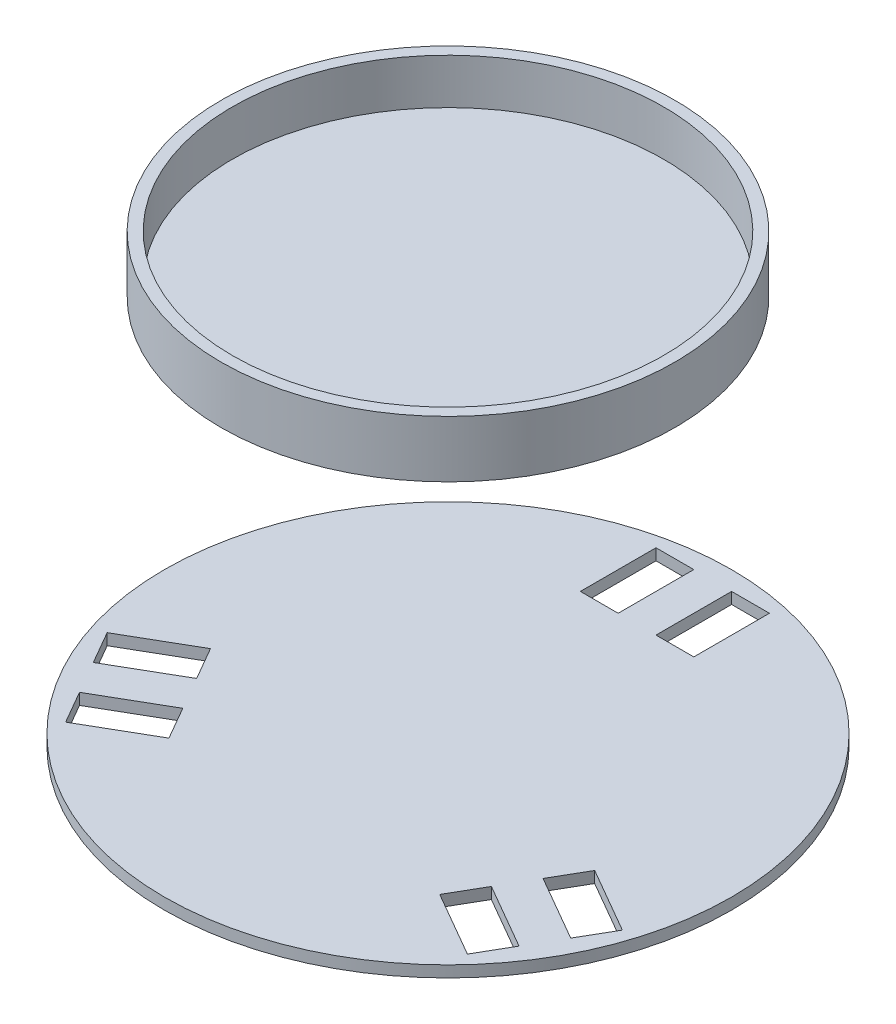
ISO-10303-21;
HEADER;
FILE_DESCRIPTION(('STEP AP214'),'2;1');
FILE_NAME('part.step','',(''),(''),'','','');
FILE_SCHEMA(('AUTOMOTIVE_DESIGN { 1 0 10303 214 1 1 1 1 }'));
ENDSEC;
DATA;
#1=APPLICATION_CONTEXT('core data for automotive mechanical design processes');
#2=APPLICATION_PROTOCOL_DEFINITION('international standard','automotive_design',2000,#1);
#3=PRODUCT_CONTEXT('',#1,'mechanical');
#4=PRODUCT('Part','Part','',(#3));
#5=PRODUCT_RELATED_PRODUCT_CATEGORY('part','',(#4));
#6=PRODUCT_DEFINITION_FORMATION('','',#4);
#7=PRODUCT_DEFINITION_CONTEXT('part definition',#1,'design');
#8=PRODUCT_DEFINITION('design','',#6,#7);
#9=PRODUCT_DEFINITION_SHAPE('','',#8);
#10=(LENGTH_UNIT() NAMED_UNIT(*) SI_UNIT(.MILLI.,.METRE.));
#11=(NAMED_UNIT(*) PLANE_ANGLE_UNIT() SI_UNIT($,.RADIAN.));
#12=(NAMED_UNIT(*) SI_UNIT($,.STERADIAN.) SOLID_ANGLE_UNIT());
#13=UNCERTAINTY_MEASURE_WITH_UNIT(LENGTH_MEASURE(1.E-05),#10,'distance_accuracy_value','');
#14=(GEOMETRIC_REPRESENTATION_CONTEXT(3) GLOBAL_UNCERTAINTY_ASSIGNED_CONTEXT((#13)) GLOBAL_UNIT_ASSIGNED_CONTEXT((#10,
#11,#12)) REPRESENTATION_CONTEXT('',''));
#15=CARTESIAN_POINT('',(0.,0.,0.));
#16=DIRECTION('',(0.,0.,1.));
#17=DIRECTION('',(1.,0.,0.));
#18=AXIS2_PLACEMENT_3D('',#15,#16,#17);
#19=CARTESIAN_POINT('',(0.,212.,0.));
#20=DIRECTION('',(0.,-1.,0.));
#21=DIRECTION('',(0.,0.,-1.));
#22=AXIS2_PLACEMENT_3D('',#19,#20,#21);
#23=CYLINDRICAL_SURFACE('',#22,120.);
#24=CARTESIAN_POINT('',(0.,206.,0.));
#25=DIRECTION('',(0.,1.,0.));
#26=DIRECTION('',(0.,0.,1.));
#27=AXIS2_PLACEMENT_3D('',#24,#25,#26);
#28=CIRCLE('',#27,120.);
#29=CARTESIAN_POINT('',(0.,206.,120.));
#30=VERTEX_POINT('',#29);
#31=EDGE_CURVE('E47',#30,#30,#28,.T.);
#32=ORIENTED_EDGE('',*,*,#31,.T.);
#33=EDGE_LOOP('',(#32));
#34=FACE_BOUND('',#33,.T.);
#35=CARTESIAN_POINT('',(0.,236.,0.));
#36=DIRECTION('',(0.,1.,0.));
#37=DIRECTION('',(0.,0.,1.));
#38=AXIS2_PLACEMENT_3D('',#35,#36,#37);
#39=CIRCLE('',#38,120.);
#40=CARTESIAN_POINT('',(0.,236.,120.));
#41=VERTEX_POINT('',#40);
#42=EDGE_CURVE('E51',#41,#41,#39,.T.);
#43=ORIENTED_EDGE('',*,*,#42,.F.);
#44=EDGE_LOOP('',(#43));
#45=FACE_BOUND('',#44,.T.);
#46=ADVANCED_FACE('F41',(#34,#45),#23,.T.);
#47=CARTESIAN_POINT('',(0.,206.,0.));
#48=DIRECTION('',(0.,1.,0.));
#49=DIRECTION('',(0.,0.,1.));
#50=AXIS2_PLACEMENT_3D('',#47,#48,#49);
#51=PLANE('',#50);
#52=ORIENTED_EDGE('',*,*,#31,.F.);
#53=EDGE_LOOP('',(#52));
#54=FACE_BOUND('',#53,.T.);
#55=ADVANCED_FACE('F65',(#54),#51,.F.);
#56=CARTESIAN_POINT('',(0.,236.,0.));
#57=DIRECTION('',(0.,1.,0.));
#58=DIRECTION('',(0.,0.,1.));
#59=AXIS2_PLACEMENT_3D('',#56,#57,#58);
#60=PLANE('',#59);
#61=ORIENTED_EDGE('',*,*,#42,.T.);
#62=EDGE_LOOP('',(#61));
#63=FACE_BOUND('',#62,.T.);
#64=CARTESIAN_POINT('',(0.,236.,0.));
#65=DIRECTION('',(0.,1.,0.));
#66=DIRECTION('',(0.,0.,1.));
#67=AXIS2_PLACEMENT_3D('',#64,#65,#66);
#68=CIRCLE('',#67,114.);
#69=CARTESIAN_POINT('',(0.,236.,114.));
#70=VERTEX_POINT('',#69);
#71=EDGE_CURVE('E55',#70,#70,#68,.T.);
#72=ORIENTED_EDGE('',*,*,#71,.F.);
#73=EDGE_LOOP('',(#72));
#74=FACE_BOUND('',#73,.T.);
#75=ADVANCED_FACE('F63',(#63,#74),#60,.T.);
#76=CARTESIAN_POINT('',(0.,236.,0.));
#77=DIRECTION('',(0.,-1.,0.));
#78=DIRECTION('',(0.,0.,-1.));
#79=AXIS2_PLACEMENT_3D('',#76,#77,#78);
#80=CYLINDRICAL_SURFACE('',#79,114.);
#81=ORIENTED_EDGE('',*,*,#71,.T.);
#82=EDGE_LOOP('',(#81));
#83=FACE_BOUND('',#82,.T.);
#84=CARTESIAN_POINT('',(0.,212.,0.));
#85=DIRECTION('',(0.,1.,0.));
#86=DIRECTION('',(0.,0.,1.));
#87=AXIS2_PLACEMENT_3D('',#84,#85,#86);
#88=CIRCLE('',#87,114.);
#89=CARTESIAN_POINT('',(0.,212.,114.));
#90=VERTEX_POINT('',#89);
#91=EDGE_CURVE('E11',#90,#90,#88,.F.);
#92=ORIENTED_EDGE('',*,*,#91,.T.);
#93=EDGE_LOOP('',(#92));
#94=FACE_BOUND('',#93,.T.);
#95=ADVANCED_FACE('F61',(#83,#94),#80,.F.);
#96=CARTESIAN_POINT('',(0.,212.,0.));
#97=DIRECTION('',(0.,1.,0.));
#98=DIRECTION('',(0.,0.,1.));
#99=AXIS2_PLACEMENT_3D('',#96,#97,#98);
#100=PLANE('',#99);
#101=ORIENTED_EDGE('',*,*,#91,.F.);
#102=EDGE_LOOP('',(#101));
#103=FACE_BOUND('',#102,.T.);
#104=ADVANCED_FACE('F72',(#103),#100,.T.);
#105=CLOSED_SHELL('',(#46,#55,#75,#95,#104));
#106=MANIFOLD_SOLID_BREP('B2',#105);
#107=CARTESIAN_POINT('',(0.,6.,0.));
#108=DIRECTION('',(0.,-1.,0.));
#109=DIRECTION('',(0.,0.,-1.));
#110=AXIS2_PLACEMENT_3D('',#107,#108,#109);
#111=CYLINDRICAL_SURFACE('',#110,150.);
#112=CARTESIAN_POINT('',(0.,6.,0.));
#113=DIRECTION('',(0.,1.,0.));
#114=DIRECTION('',(0.,0.,1.));
#115=AXIS2_PLACEMENT_3D('',#112,#113,#114);
#116=CIRCLE('',#115,150.);
#117=CARTESIAN_POINT('',(0.,6.,150.));
#118=VERTEX_POINT('',#117);
#119=EDGE_CURVE('E39',#118,#118,#116,.T.);
#120=ORIENTED_EDGE('',*,*,#119,.F.);
#121=EDGE_LOOP('',(#120));
#122=FACE_BOUND('',#121,.T.);
#123=CARTESIAN_POINT('',(0.,0.,0.));
#124=DIRECTION('',(0.,1.,0.));
#125=DIRECTION('',(0.,0.,1.));
#126=AXIS2_PLACEMENT_3D('',#123,#124,#125);
#127=CIRCLE('',#126,150.);
#128=CARTESIAN_POINT('',(0.,0.,150.));
#129=VERTEX_POINT('',#128);
#130=EDGE_CURVE('E118',#129,#129,#127,.T.);
#131=ORIENTED_EDGE('',*,*,#130,.T.);
#132=EDGE_LOOP('',(#131));
#133=FACE_BOUND('',#132,.T.);
#134=ADVANCED_FACE('F115',(#122,#133),#111,.T.);
#135=CARTESIAN_POINT('',(0.,6.,0.));
#136=DIRECTION('',(0.,1.,0.));
#137=DIRECTION('',(0.,0.,1.));
#138=AXIS2_PLACEMENT_3D('',#135,#136,#137);
#139=PLANE('',#138);
#140=DIRECTION('',(0.5,0.,0.866025403784438));
#141=VECTOR('',#140,1.);
#142=CARTESIAN_POINT('',(-126.243556529779,6.,61.3397459621752));
#143=LINE('',#142,#141);
#144=CARTESIAN_POINT('',(-136.243556529779,6.,44.0192378864865));
#145=VERTEX_POINT('',#144);
#146=CARTESIAN_POINT('',(-126.243556529779,6.,61.3397459621752));
#147=VERTEX_POINT('',#146);
#148=EDGE_CURVE('E129',#145,#147,#143,.T.);
#149=ORIENTED_EDGE('',*,*,#148,.F.);
#150=DIRECTION('',(-0.866025403784438,0.,0.5));
#151=VECTOR('',#150,1.);
#152=CARTESIAN_POINT('',(-136.243556529779,6.,44.0192378864865));
#153=LINE('',#152,#151);
#154=CARTESIAN_POINT('',(-101.602540378401,6.,24.0192378864864));
#155=VERTEX_POINT('',#154);
#156=EDGE_CURVE('E354',#155,#145,#153,.T.);
#157=ORIENTED_EDGE('',*,*,#156,.F.);
#158=DIRECTION('',(-0.5,0.,-0.866025403784438));
#159=VECTOR('',#158,1.);
#160=CARTESIAN_POINT('',(-91.6025403784012,6.,41.3397459621752));
#161=LINE('',#160,#159);
#162=CARTESIAN_POINT('',(-91.6025403784012,6.,41.3397459621752));
#163=VERTEX_POINT('',#162);
#164=EDGE_CURVE('E368',#163,#155,#161,.T.);
#165=ORIENTED_EDGE('',*,*,#164,.F.);
#166=DIRECTION('',(0.866025403784438,0.,-0.500000000000001));
#167=VECTOR('',#166,1.);
#168=CARTESIAN_POINT('',(-126.243556529779,6.,61.3397459621752));
#169=LINE('',#168,#167);
#170=EDGE_CURVE('E365',#147,#163,#169,.T.);
#171=ORIENTED_EDGE('',*,*,#170,.F.);
#172=EDGE_LOOP('',(#149,#157,#165,#171));
#173=FACE_BOUND('',#172,.T.);
#174=DIRECTION('',(0.866025403784438,0.,-0.5));
#175=VECTOR('',#174,1.);
#176=CARTESIAN_POINT('',(-106.243556529779,6.,95.9807621135527));
#177=LINE('',#176,#175);
#178=CARTESIAN_POINT('',(-106.243556529779,6.,95.9807621135527));
#179=VERTEX_POINT('',#178);
#180=CARTESIAN_POINT('',(-71.6025403784011,6.,75.9807621135527));
#181=VERTEX_POINT('',#180);
#182=EDGE_CURVE('E137',#179,#181,#177,.T.);
#183=ORIENTED_EDGE('',*,*,#182,.F.);
#184=DIRECTION('',(0.5,0.,0.866025403784438));
#185=VECTOR('',#184,1.);
#186=CARTESIAN_POINT('',(-116.243556529779,6.,78.660254037864));
#187=LINE('',#186,#185);
#188=CARTESIAN_POINT('',(-116.243556529779,6.,78.660254037864));
#189=VERTEX_POINT('',#188);
#190=EDGE_CURVE('E324',#189,#179,#187,.T.);
#191=ORIENTED_EDGE('',*,*,#190,.F.);
#192=DIRECTION('',(-0.866025403784439,0.,0.5));
#193=VECTOR('',#192,1.);
#194=CARTESIAN_POINT('',(-116.243556529779,6.,78.660254037864));
#195=LINE('',#194,#193);
#196=CARTESIAN_POINT('',(-81.6025403784011,6.,58.660254037864));
#197=VERTEX_POINT('',#196);
#198=EDGE_CURVE('E338',#197,#189,#195,.T.);
#199=ORIENTED_EDGE('',*,*,#198,.F.);
#200=DIRECTION('',(-0.500000000000001,0.,-0.866025403784438));
#201=VECTOR('',#200,1.);
#202=CARTESIAN_POINT('',(-81.6025403784011,6.,58.660254037864));
#203=LINE('',#202,#201);
#204=EDGE_CURVE('E335',#181,#197,#203,.T.);
#205=ORIENTED_EDGE('',*,*,#204,.F.);
#206=EDGE_LOOP('',(#183,#191,#199,#205));
#207=FACE_BOUND('',#206,.T.);
#208=DIRECTION('',(-0.866025403784439,0.,-0.5));
#209=VECTOR('',#208,1.);
#210=CARTESIAN_POINT('',(136.24355652986,6.,44.0192378864396));
#211=LINE('',#210,#209);
#212=CARTESIAN_POINT('',(136.24355652986,6.,44.0192378864396));
#213=VERTEX_POINT('',#212);
#214=CARTESIAN_POINT('',(101.602540378482,6.,24.0192378864396));
#215=VERTEX_POINT('',#214);
#216=EDGE_CURVE('E282',#213,#215,#211,.T.);
#217=ORIENTED_EDGE('',*,*,#216,.F.);
#218=DIRECTION('',(0.5,0.,-0.866025403784438));
#219=VECTOR('',#218,1.);
#220=CARTESIAN_POINT('',(126.24355652986,6.,61.3397459621284));
#221=LINE('',#220,#219);
#222=CARTESIAN_POINT('',(126.24355652986,6.,61.3397459621284));
#223=VERTEX_POINT('',#222);
#224=EDGE_CURVE('E300',#223,#213,#221,.T.);
#225=ORIENTED_EDGE('',*,*,#224,.F.);
#226=DIRECTION('',(0.866025403784439,0.,0.5));
#227=VECTOR('',#226,1.);
#228=CARTESIAN_POINT('',(126.24355652986,6.,61.3397459621284));
#229=LINE('',#228,#227);
#230=CARTESIAN_POINT('',(91.6025403784822,6.,41.3397459621284));
#231=VERTEX_POINT('',#230);
#232=EDGE_CURVE('E303',#231,#223,#229,.T.);
#233=ORIENTED_EDGE('',*,*,#232,.F.);
#234=DIRECTION('',(-0.5,0.,0.866025403784439));
#235=VECTOR('',#234,1.);
#236=CARTESIAN_POINT('',(91.6025403784822,6.,41.3397459621284));
#237=LINE('',#236,#235);
#238=EDGE_CURVE('E309',#215,#231,#237,.T.);
#239=ORIENTED_EDGE('',*,*,#238,.F.);
#240=EDGE_LOOP('',(#217,#225,#233,#239));
#241=FACE_BOUND('',#240,.T.);
#242=DIRECTION('',(0.5,0.,-0.866025403784439));
#243=VECTOR('',#242,1.);
#244=CARTESIAN_POINT('',(116.24355652986,6.,78.6602540378172));
#245=LINE('',#244,#243);
#246=CARTESIAN_POINT('',(106.24355652986,6.,95.9807621135059));
#247=VERTEX_POINT('',#246);
#248=CARTESIAN_POINT('',(116.24355652986,6.,78.6602540378172));
#249=VERTEX_POINT('',#248);
#250=EDGE_CURVE('E316',#247,#249,#245,.T.);
#251=ORIENTED_EDGE('',*,*,#250,.F.);
#252=DIRECTION('',(0.866025403784439,0.,0.499999999999999));
#253=VECTOR('',#252,1.);
#254=CARTESIAN_POINT('',(106.24355652986,6.,95.9807621135059));
#255=LINE('',#254,#253);
#256=CARTESIAN_POINT('',(71.6025403784822,6.,75.980762113506));
#257=VERTEX_POINT('',#256);
#258=EDGE_CURVE('E417',#257,#247,#255,.T.);
#259=ORIENTED_EDGE('',*,*,#258,.F.);
#260=DIRECTION('',(-0.5,0.,0.866025403784438));
#261=VECTOR('',#260,1.);
#262=CARTESIAN_POINT('',(81.6025403784822,6.,58.6602540378172));
#263=LINE('',#262,#261);
#264=CARTESIAN_POINT('',(81.6025403784822,6.,58.6602540378172));
#265=VERTEX_POINT('',#264);
#266=EDGE_CURVE('E431',#265,#257,#263,.T.);
#267=ORIENTED_EDGE('',*,*,#266,.F.);
#268=DIRECTION('',(-0.866025403784439,0.,-0.499999999999999));
#269=VECTOR('',#268,1.);
#270=CARTESIAN_POINT('',(116.24355652986,6.,78.6602540378172));
#271=LINE('',#270,#269);
#272=EDGE_CURVE('E428',#249,#265,#271,.T.);
#273=ORIENTED_EDGE('',*,*,#272,.F.);
#274=EDGE_LOOP('',(#251,#259,#267,#273));
#275=FACE_BOUND('',#274,.T.);
#276=DIRECTION('',(-1.,0.,0.));
#277=VECTOR('',#276,1.);
#278=CARTESIAN_POINT('',(-9.99999999999999,6.,-140.));
#279=LINE('',#278,#277);
#280=CARTESIAN_POINT('',(-9.99999999999999,6.,-140.));
#281=VERTEX_POINT('',#280);
#282=CARTESIAN_POINT('',(-30.,6.,-140.));
#283=VERTEX_POINT('',#282);
#284=EDGE_CURVE('E393',#281,#283,#279,.T.);
#285=ORIENTED_EDGE('',*,*,#284,.F.);
#286=DIRECTION('',(0.,0.,-1.));
#287=VECTOR('',#286,1.);
#288=CARTESIAN_POINT('',(-9.99999999999999,6.,-140.));
#289=LINE('',#288,#287);
#290=CARTESIAN_POINT('',(-9.99999999999999,6.,-100.));
#291=VERTEX_POINT('',#290);
#292=EDGE_CURVE('E383',#291,#281,#289,.T.);
#293=ORIENTED_EDGE('',*,*,#292,.F.);
#294=DIRECTION('',(1.,0.,0.));
#295=VECTOR('',#294,1.);
#296=CARTESIAN_POINT('',(-9.99999999999999,6.,-100.));
#297=LINE('',#296,#295);
#298=CARTESIAN_POINT('',(-30.,6.,-100.));
#299=VERTEX_POINT('',#298);
#300=EDGE_CURVE('E399',#299,#291,#297,.T.);
#301=ORIENTED_EDGE('',*,*,#300,.F.);
#302=DIRECTION('',(0.,0.,1.));
#303=VECTOR('',#302,1.);
#304=CARTESIAN_POINT('',(-30.,6.,-140.));
#305=LINE('',#304,#303);
#306=EDGE_CURVE('E395',#283,#299,#305,.T.);
#307=ORIENTED_EDGE('',*,*,#306,.F.);
#308=EDGE_LOOP('',(#285,#293,#301,#307));
#309=FACE_BOUND('',#308,.T.);
#310=DIRECTION('',(0.,0.,1.));
#311=VECTOR('',#310,1.);
#312=CARTESIAN_POINT('',(9.99999999999999,6.,-140.));
#313=LINE('',#312,#311);
#314=CARTESIAN_POINT('',(9.99999999999999,6.,-140.));
#315=VERTEX_POINT('',#314);
#316=CARTESIAN_POINT('',(9.99999999999999,6.,-100.));
#317=VERTEX_POINT('',#316);
#318=EDGE_CURVE('E406',#315,#317,#313,.T.);
#319=ORIENTED_EDGE('',*,*,#318,.F.);
#320=DIRECTION('',(-1.,0.,0.));
#321=VECTOR('',#320,1.);
#322=CARTESIAN_POINT('',(9.99999999999999,6.,-140.));
#323=LINE('',#322,#321);
#324=CARTESIAN_POINT('',(30.,6.,-140.));
#325=VERTEX_POINT('',#324);
#326=EDGE_CURVE('E447',#325,#315,#323,.T.);
#327=ORIENTED_EDGE('',*,*,#326,.F.);
#328=DIRECTION('',(0.,0.,-1.));
#329=VECTOR('',#328,1.);
#330=CARTESIAN_POINT('',(30.,6.,-140.));
#331=LINE('',#330,#329);
#332=CARTESIAN_POINT('',(30.,6.,-100.));
#333=VERTEX_POINT('',#332);
#334=EDGE_CURVE('E461',#333,#325,#331,.T.);
#335=ORIENTED_EDGE('',*,*,#334,.F.);
#336=DIRECTION('',(1.,0.,0.));
#337=VECTOR('',#336,1.);
#338=CARTESIAN_POINT('',(9.99999999999999,6.,-100.));
#339=LINE('',#338,#337);
#340=EDGE_CURVE('E458',#317,#333,#339,.T.);
#341=ORIENTED_EDGE('',*,*,#340,.F.);
#342=EDGE_LOOP('',(#319,#327,#335,#341));
#343=FACE_BOUND('',#342,.T.);
#344=ORIENTED_EDGE('',*,*,#119,.T.);
#345=EDGE_LOOP('',(#344));
#346=FACE_BOUND('',#345,.T.);
#347=ADVANCED_FACE('F483',(#173,#207,#241,#275,#309,#343,#346),#139,.T.);
#348=CARTESIAN_POINT('',(0.,0.,0.));
#349=DIRECTION('',(0.,1.,0.));
#350=DIRECTION('',(0.,0.,1.));
#351=AXIS2_PLACEMENT_3D('',#348,#349,#350);
#352=PLANE('',#351);
#353=DIRECTION('',(-0.866025403784438,0.,0.5));
#354=VECTOR('',#353,1.);
#355=CARTESIAN_POINT('',(-136.243556529779,0.,44.0192378864865));
#356=LINE('',#355,#354);
#357=CARTESIAN_POINT('',(-101.602540378401,0.,24.0192378864864));
#358=VERTEX_POINT('',#357);
#359=CARTESIAN_POINT('',(-136.243556529779,0.,44.0192378864865));
#360=VERTEX_POINT('',#359);
#361=EDGE_CURVE('E360',#358,#360,#356,.T.);
#362=ORIENTED_EDGE('',*,*,#361,.T.);
#363=DIRECTION('',(0.5,0.,0.866025403784438));
#364=VECTOR('',#363,1.);
#365=CARTESIAN_POINT('',(-126.243556529779,0.,61.3397459621752));
#366=LINE('',#365,#364);
#367=CARTESIAN_POINT('',(-126.243556529779,0.,61.3397459621752));
#368=VERTEX_POINT('',#367);
#369=EDGE_CURVE('E350',#360,#368,#366,.T.);
#370=ORIENTED_EDGE('',*,*,#369,.T.);
#371=DIRECTION('',(0.866025403784438,0.,-0.500000000000001));
#372=VECTOR('',#371,1.);
#373=CARTESIAN_POINT('',(-126.243556529779,0.,61.3397459621752));
#374=LINE('',#373,#372);
#375=CARTESIAN_POINT('',(-91.6025403784011,0.,41.3397459621752));
#376=VERTEX_POINT('',#375);
#377=EDGE_CURVE('E353',#368,#376,#374,.T.);
#378=ORIENTED_EDGE('',*,*,#377,.T.);
#379=DIRECTION('',(-0.5,0.,-0.866025403784438));
#380=VECTOR('',#379,1.);
#381=CARTESIAN_POINT('',(-91.6025403784012,0.,41.3397459621752));
#382=LINE('',#381,#380);
#383=EDGE_CURVE('E357',#376,#358,#382,.T.);
#384=ORIENTED_EDGE('',*,*,#383,.T.);
#385=EDGE_LOOP('',(#362,#370,#378,#384));
#386=FACE_BOUND('',#385,.T.);
#387=DIRECTION('',(0.5,0.,0.866025403784438));
#388=VECTOR('',#387,1.);
#389=CARTESIAN_POINT('',(-116.243556529779,0.,78.660254037864));
#390=LINE('',#389,#388);
#391=CARTESIAN_POINT('',(-116.243556529779,0.,78.660254037864));
#392=VERTEX_POINT('',#391);
#393=CARTESIAN_POINT('',(-106.243556529779,0.,95.9807621135527));
#394=VERTEX_POINT('',#393);
#395=EDGE_CURVE('E330',#392,#394,#390,.T.);
#396=ORIENTED_EDGE('',*,*,#395,.T.);
#397=DIRECTION('',(0.866025403784438,0.,-0.5));
#398=VECTOR('',#397,1.);
#399=CARTESIAN_POINT('',(-106.243556529779,0.,95.9807621135527));
#400=LINE('',#399,#398);
#401=CARTESIAN_POINT('',(-71.6025403784011,0.,75.9807621135527));
#402=VERTEX_POINT('',#401);
#403=EDGE_CURVE('E320',#394,#402,#400,.T.);
#404=ORIENTED_EDGE('',*,*,#403,.T.);
#405=DIRECTION('',(-0.500000000000001,0.,-0.866025403784438));
#406=VECTOR('',#405,1.);
#407=CARTESIAN_POINT('',(-81.6025403784011,0.,58.660254037864));
#408=LINE('',#407,#406);
#409=CARTESIAN_POINT('',(-81.6025403784011,0.,58.660254037864));
#410=VERTEX_POINT('',#409);
#411=EDGE_CURVE('E323',#402,#410,#408,.T.);
#412=ORIENTED_EDGE('',*,*,#411,.T.);
#413=DIRECTION('',(-0.866025403784439,0.,0.5));
#414=VECTOR('',#413,1.);
#415=CARTESIAN_POINT('',(-116.243556529779,0.,78.660254037864));
#416=LINE('',#415,#414);
#417=EDGE_CURVE('E327',#410,#392,#416,.T.);
#418=ORIENTED_EDGE('',*,*,#417,.T.);
#419=EDGE_LOOP('',(#396,#404,#412,#418));
#420=FACE_BOUND('',#419,.T.);
#421=DIRECTION('',(0.5,0.,-0.866025403784438));
#422=VECTOR('',#421,1.);
#423=CARTESIAN_POINT('',(126.24355652986,0.,61.3397459621284));
#424=LINE('',#423,#422);
#425=CARTESIAN_POINT('',(126.24355652986,0.,61.3397459621284));
#426=VERTEX_POINT('',#425);
#427=CARTESIAN_POINT('',(136.24355652986,0.,44.0192378864396));
#428=VERTEX_POINT('',#427);
#429=EDGE_CURVE('E287',#426,#428,#424,.T.);
#430=ORIENTED_EDGE('',*,*,#429,.T.);
#431=DIRECTION('',(-0.866025403784439,0.,-0.5));
#432=VECTOR('',#431,1.);
#433=CARTESIAN_POINT('',(136.24355652986,0.,44.0192378864396));
#434=LINE('',#433,#432);
#435=CARTESIAN_POINT('',(101.602540378482,0.,24.0192378864396));
#436=VERTEX_POINT('',#435);
#437=EDGE_CURVE('E279',#428,#436,#434,.T.);
#438=ORIENTED_EDGE('',*,*,#437,.T.);
#439=DIRECTION('',(-0.5,0.,0.866025403784439));
#440=VECTOR('',#439,1.);
#441=CARTESIAN_POINT('',(91.6025403784822,0.,41.3397459621284));
#442=LINE('',#441,#440);
#443=CARTESIAN_POINT('',(91.6025403784822,0.,41.3397459621284));
#444=VERTEX_POINT('',#443);
#445=EDGE_CURVE('E291',#436,#444,#442,.T.);
#446=ORIENTED_EDGE('',*,*,#445,.T.);
#447=DIRECTION('',(0.866025403784439,0.,0.5));
#448=VECTOR('',#447,1.);
#449=CARTESIAN_POINT('',(126.24355652986,0.,61.3397459621284));
#450=LINE('',#449,#448);
#451=EDGE_CURVE('E295',#444,#426,#450,.T.);
#452=ORIENTED_EDGE('',*,*,#451,.T.);
#453=EDGE_LOOP('',(#430,#438,#446,#452));
#454=FACE_BOUND('',#453,.T.);
#455=DIRECTION('',(0.866025403784439,0.,0.499999999999999));
#456=VECTOR('',#455,1.);
#457=CARTESIAN_POINT('',(106.24355652986,0.,95.9807621135059));
#458=LINE('',#457,#456);
#459=CARTESIAN_POINT('',(71.6025403784822,0.,75.980762113506));
#460=VERTEX_POINT('',#459);
#461=CARTESIAN_POINT('',(106.24355652986,0.,95.9807621135059));
#462=VERTEX_POINT('',#461);
#463=EDGE_CURVE('E423',#460,#462,#458,.T.);
#464=ORIENTED_EDGE('',*,*,#463,.T.);
#465=DIRECTION('',(0.5,0.,-0.866025403784439));
#466=VECTOR('',#465,1.);
#467=CARTESIAN_POINT('',(116.24355652986,0.,78.6602540378172));
#468=LINE('',#467,#466);
#469=CARTESIAN_POINT('',(116.24355652986,0.,78.6602540378172));
#470=VERTEX_POINT('',#469);
#471=EDGE_CURVE('E413',#462,#470,#468,.T.);
#472=ORIENTED_EDGE('',*,*,#471,.T.);
#473=DIRECTION('',(-0.866025403784439,0.,-0.499999999999999));
#474=VECTOR('',#473,1.);
#475=CARTESIAN_POINT('',(116.24355652986,0.,78.6602540378172));
#476=LINE('',#475,#474);
#477=CARTESIAN_POINT('',(81.6025403784821,0.,58.6602540378172));
#478=VERTEX_POINT('',#477);
#479=EDGE_CURVE('E416',#470,#478,#476,.T.);
#480=ORIENTED_EDGE('',*,*,#479,.T.);
#481=DIRECTION('',(-0.5,0.,0.866025403784438));
#482=VECTOR('',#481,1.);
#483=CARTESIAN_POINT('',(81.6025403784822,0.,58.6602540378172));
#484=LINE('',#483,#482);
#485=EDGE_CURVE('E420',#478,#460,#484,.T.);
#486=ORIENTED_EDGE('',*,*,#485,.T.);
#487=EDGE_LOOP('',(#464,#472,#480,#486));
#488=FACE_BOUND('',#487,.T.);
#489=DIRECTION('',(0.,0.,-1.));
#490=VECTOR('',#489,1.);
#491=CARTESIAN_POINT('',(-9.99999999999999,0.,-140.));
#492=LINE('',#491,#490);
#493=CARTESIAN_POINT('',(-9.99999999999999,0.,-100.));
#494=VERTEX_POINT('',#493);
#495=CARTESIAN_POINT('',(-9.99999999999999,0.,-140.));
#496=VERTEX_POINT('',#495);
#497=EDGE_CURVE('E389',#494,#496,#492,.T.);
#498=ORIENTED_EDGE('',*,*,#497,.T.);
#499=DIRECTION('',(-1.,0.,0.));
#500=VECTOR('',#499,1.);
#501=CARTESIAN_POINT('',(-9.99999999999999,0.,-140.));
#502=LINE('',#501,#500);
#503=CARTESIAN_POINT('',(-30.,0.,-140.));
#504=VERTEX_POINT('',#503);
#505=EDGE_CURVE('E379',#496,#504,#502,.T.);
#506=ORIENTED_EDGE('',*,*,#505,.T.);
#507=DIRECTION('',(0.,0.,1.));
#508=VECTOR('',#507,1.);
#509=CARTESIAN_POINT('',(-30.,0.,-140.));
#510=LINE('',#509,#508);
#511=CARTESIAN_POINT('',(-30.,0.,-100.));
#512=VERTEX_POINT('',#511);
#513=EDGE_CURVE('E382',#504,#512,#510,.T.);
#514=ORIENTED_EDGE('',*,*,#513,.T.);
#515=DIRECTION('',(1.,0.,0.));
#516=VECTOR('',#515,1.);
#517=CARTESIAN_POINT('',(-9.99999999999999,0.,-100.));
#518=LINE('',#517,#516);
#519=EDGE_CURVE('E386',#512,#494,#518,.T.);
#520=ORIENTED_EDGE('',*,*,#519,.T.);
#521=EDGE_LOOP('',(#498,#506,#514,#520));
#522=FACE_BOUND('',#521,.T.);
#523=DIRECTION('',(-1.,0.,0.));
#524=VECTOR('',#523,1.);
#525=CARTESIAN_POINT('',(9.99999999999999,0.,-140.));
#526=LINE('',#525,#524);
#527=CARTESIAN_POINT('',(30.,0.,-140.));
#528=VERTEX_POINT('',#527);
#529=CARTESIAN_POINT('',(9.99999999999999,0.,-140.));
#530=VERTEX_POINT('',#529);
#531=EDGE_CURVE('E453',#528,#530,#526,.T.);
#532=ORIENTED_EDGE('',*,*,#531,.T.);
#533=DIRECTION('',(0.,0.,1.));
#534=VECTOR('',#533,1.);
#535=CARTESIAN_POINT('',(9.99999999999999,0.,-140.));
#536=LINE('',#535,#534);
#537=CARTESIAN_POINT('',(9.99999999999999,0.,-100.));
#538=VERTEX_POINT('',#537);
#539=EDGE_CURVE('E443',#530,#538,#536,.T.);
#540=ORIENTED_EDGE('',*,*,#539,.T.);
#541=DIRECTION('',(1.,0.,0.));
#542=VECTOR('',#541,1.);
#543=CARTESIAN_POINT('',(9.99999999999999,0.,-100.));
#544=LINE('',#543,#542);
#545=CARTESIAN_POINT('',(30.,0.,-100.));
#546=VERTEX_POINT('',#545);
#547=EDGE_CURVE('E446',#538,#546,#544,.T.);
#548=ORIENTED_EDGE('',*,*,#547,.T.);
#549=DIRECTION('',(0.,0.,-1.));
#550=VECTOR('',#549,1.);
#551=CARTESIAN_POINT('',(30.,0.,-140.));
#552=LINE('',#551,#550);
#553=EDGE_CURVE('E450',#546,#528,#552,.T.);
#554=ORIENTED_EDGE('',*,*,#553,.T.);
#555=EDGE_LOOP('',(#532,#540,#548,#554));
#556=FACE_BOUND('',#555,.T.);
#557=ORIENTED_EDGE('',*,*,#130,.F.);
#558=EDGE_LOOP('',(#557));
#559=FACE_BOUND('',#558,.T.);
#560=ADVANCED_FACE('F297',(#386,#420,#454,#488,#522,#556,#559),#352,.F.);
#561=CARTESIAN_POINT('',(9.99999999999999,0.,-140.));
#562=DIRECTION('',(-1.,0.,0.));
#563=DIRECTION('',(0.,0.,1.));
#564=AXIS2_PLACEMENT_3D('',#561,#562,#563);
#565=PLANE('',#564);
#566=ORIENTED_EDGE('',*,*,#318,.T.);
#567=DIRECTION('',(0.,1.,0.));
#568=VECTOR('',#567,1.);
#569=CARTESIAN_POINT('',(9.99999999999999,0.,-100.));
#570=LINE('',#569,#568);
#571=EDGE_CURVE('E456',#538,#317,#570,.T.);
#572=ORIENTED_EDGE('',*,*,#571,.F.);
#573=ORIENTED_EDGE('',*,*,#539,.F.);
#574=DIRECTION('',(0.,1.,0.));
#575=VECTOR('',#574,1.);
#576=CARTESIAN_POINT('',(9.99999999999999,0.,-140.));
#577=LINE('',#576,#575);
#578=EDGE_CURVE('E466',#530,#315,#577,.T.);
#579=ORIENTED_EDGE('',*,*,#578,.T.);
#580=EDGE_LOOP('',(#566,#572,#573,#579));
#581=FACE_BOUND('',#580,.T.);
#582=ADVANCED_FACE('F491',(#581),#565,.F.);
#583=CARTESIAN_POINT('',(9.99999999999999,0.,-140.));
#584=DIRECTION('',(0.,0.,-1.));
#585=DIRECTION('',(-1.,0.,0.));
#586=AXIS2_PLACEMENT_3D('',#583,#584,#585);
#587=PLANE('',#586);
#588=ORIENTED_EDGE('',*,*,#326,.T.);
#589=ORIENTED_EDGE('',*,*,#578,.F.);
#590=ORIENTED_EDGE('',*,*,#531,.F.);
#591=DIRECTION('',(0.,1.,0.));
#592=VECTOR('',#591,1.);
#593=CARTESIAN_POINT('',(30.,0.,-140.));
#594=LINE('',#593,#592);
#595=EDGE_CURVE('E468',#528,#325,#594,.T.);
#596=ORIENTED_EDGE('',*,*,#595,.T.);
#597=EDGE_LOOP('',(#588,#589,#590,#596));
#598=FACE_BOUND('',#597,.T.);
#599=ADVANCED_FACE('F493',(#598),#587,.F.);
#600=CARTESIAN_POINT('',(30.,0.,-140.));
#601=DIRECTION('',(1.,0.,0.));
#602=DIRECTION('',(0.,0.,-1.));
#603=AXIS2_PLACEMENT_3D('',#600,#601,#602);
#604=PLANE('',#603);
#605=ORIENTED_EDGE('',*,*,#334,.T.);
#606=ORIENTED_EDGE('',*,*,#595,.F.);
#607=ORIENTED_EDGE('',*,*,#553,.F.);
#608=DIRECTION('',(0.,1.,0.));
#609=VECTOR('',#608,1.);
#610=CARTESIAN_POINT('',(30.,0.,-100.));
#611=LINE('',#610,#609);
#612=EDGE_CURVE('E470',#546,#333,#611,.T.);
#613=ORIENTED_EDGE('',*,*,#612,.T.);
#614=EDGE_LOOP('',(#605,#606,#607,#613));
#615=FACE_BOUND('',#614,.T.);
#616=ADVANCED_FACE('F487',(#615),#604,.F.);
#617=CARTESIAN_POINT('',(9.99999999999999,0.,-100.));
#618=DIRECTION('',(0.,0.,1.));
#619=DIRECTION('',(1.,0.,0.));
#620=AXIS2_PLACEMENT_3D('',#617,#618,#619);
#621=PLANE('',#620);
#622=ORIENTED_EDGE('',*,*,#340,.T.);
#623=ORIENTED_EDGE('',*,*,#612,.F.);
#624=ORIENTED_EDGE('',*,*,#547,.F.);
#625=ORIENTED_EDGE('',*,*,#571,.T.);
#626=EDGE_LOOP('',(#622,#623,#624,#625));
#627=FACE_BOUND('',#626,.T.);
#628=ADVANCED_FACE('F476',(#627),#621,.F.);
#629=CARTESIAN_POINT('',(-9.99999999999999,0.,-140.));
#630=DIRECTION('',(0.,0.,-1.));
#631=DIRECTION('',(-1.,0.,0.));
#632=AXIS2_PLACEMENT_3D('',#629,#630,#631);
#633=PLANE('',#632);
#634=ORIENTED_EDGE('',*,*,#284,.T.);
#635=DIRECTION('',(0.,1.,0.));
#636=VECTOR('',#635,1.);
#637=CARTESIAN_POINT('',(-30.,0.,-140.));
#638=LINE('',#637,#636);
#639=EDGE_CURVE('E392',#504,#283,#638,.T.);
#640=ORIENTED_EDGE('',*,*,#639,.F.);
#641=ORIENTED_EDGE('',*,*,#505,.F.);
#642=DIRECTION('',(0.,1.,0.));
#643=VECTOR('',#642,1.);
#644=CARTESIAN_POINT('',(-9.99999999999999,0.,-140.));
#645=LINE('',#644,#643);
#646=EDGE_CURVE('E404',#496,#281,#645,.T.);
#647=ORIENTED_EDGE('',*,*,#646,.T.);
#648=EDGE_LOOP('',(#634,#640,#641,#647));
#649=FACE_BOUND('',#648,.T.);
#650=ADVANCED_FACE('F521',(#649),#633,.F.);
#651=CARTESIAN_POINT('',(-9.99999999999999,0.,-140.));
#652=DIRECTION('',(1.,0.,0.));
#653=DIRECTION('',(0.,0.,-1.));
#654=AXIS2_PLACEMENT_3D('',#651,#652,#653);
#655=PLANE('',#654);
#656=ORIENTED_EDGE('',*,*,#292,.T.);
#657=ORIENTED_EDGE('',*,*,#646,.F.);
#658=ORIENTED_EDGE('',*,*,#497,.F.);
#659=DIRECTION('',(0.,1.,0.));
#660=VECTOR('',#659,1.);
#661=CARTESIAN_POINT('',(-9.99999999999999,0.,-100.));
#662=LINE('',#661,#660);
#663=EDGE_CURVE('E407',#494,#291,#662,.T.);
#664=ORIENTED_EDGE('',*,*,#663,.T.);
#665=EDGE_LOOP('',(#656,#657,#658,#664));
#666=FACE_BOUND('',#665,.T.);
#667=ADVANCED_FACE('F525',(#666),#655,.F.);
#668=CARTESIAN_POINT('',(-9.99999999999999,0.,-100.));
#669=DIRECTION('',(0.,0.,1.));
#670=DIRECTION('',(1.,0.,0.));
#671=AXIS2_PLACEMENT_3D('',#668,#669,#670);
#672=PLANE('',#671);
#673=ORIENTED_EDGE('',*,*,#300,.T.);
#674=ORIENTED_EDGE('',*,*,#663,.F.);
#675=ORIENTED_EDGE('',*,*,#519,.F.);
#676=DIRECTION('',(0.,1.,0.));
#677=VECTOR('',#676,1.);
#678=CARTESIAN_POINT('',(-30.,0.,-100.));
#679=LINE('',#678,#677);
#680=EDGE_CURVE('E409',#512,#299,#679,.T.);
#681=ORIENTED_EDGE('',*,*,#680,.T.);
#682=EDGE_LOOP('',(#673,#674,#675,#681));
#683=FACE_BOUND('',#682,.T.);
#684=ADVANCED_FACE('F531',(#683),#672,.F.);
#685=CARTESIAN_POINT('',(-30.,0.,-140.));
#686=DIRECTION('',(-1.,0.,0.));
#687=DIRECTION('',(0.,0.,1.));
#688=AXIS2_PLACEMENT_3D('',#685,#686,#687);
#689=PLANE('',#688);
#690=ORIENTED_EDGE('',*,*,#306,.T.);
#691=ORIENTED_EDGE('',*,*,#680,.F.);
#692=ORIENTED_EDGE('',*,*,#513,.F.);
#693=ORIENTED_EDGE('',*,*,#639,.T.);
#694=EDGE_LOOP('',(#690,#691,#692,#693));
#695=FACE_BOUND('',#694,.T.);
#696=ADVANCED_FACE('F536',(#695),#689,.F.);
#697=CARTESIAN_POINT('',(116.24355652986,0.,78.6602540378172));
#698=DIRECTION('',(0.866025403784439,0.,0.5));
#699=DIRECTION('',(0.5,0.,-0.866025403784439));
#700=AXIS2_PLACEMENT_3D('',#697,#698,#699);
#701=PLANE('',#700);
#702=ORIENTED_EDGE('',*,*,#250,.T.);
#703=DIRECTION('',(0.,1.,0.));
#704=VECTOR('',#703,1.);
#705=CARTESIAN_POINT('',(116.24355652986,0.,78.6602540378172));
#706=LINE('',#705,#704);
#707=EDGE_CURVE('E426',#470,#249,#706,.T.);
#708=ORIENTED_EDGE('',*,*,#707,.F.);
#709=ORIENTED_EDGE('',*,*,#471,.F.);
#710=DIRECTION('',(0.,1.,0.));
#711=VECTOR('',#710,1.);
#712=CARTESIAN_POINT('',(106.24355652986,0.,95.9807621135059));
#713=LINE('',#712,#711);
#714=EDGE_CURVE('E396',#462,#247,#713,.T.);
#715=ORIENTED_EDGE('',*,*,#714,.T.);
#716=EDGE_LOOP('',(#702,#708,#709,#715));
#717=FACE_BOUND('',#716,.T.);
#718=ADVANCED_FACE('F542',(#717),#701,.F.);
#719=CARTESIAN_POINT('',(106.24355652986,0.,95.9807621135059));
#720=DIRECTION('',(-0.499999999999999,0.,0.866025403784439));
#721=DIRECTION('',(0.866025403784439,0.,0.499999999999999));
#722=AXIS2_PLACEMENT_3D('',#719,#720,#721);
#723=PLANE('',#722);
#724=ORIENTED_EDGE('',*,*,#258,.T.);
#725=ORIENTED_EDGE('',*,*,#714,.F.);
#726=ORIENTED_EDGE('',*,*,#463,.F.);
#727=DIRECTION('',(0.,1.,0.));
#728=VECTOR('',#727,1.);
#729=CARTESIAN_POINT('',(71.6025403784822,0.,75.980762113506));
#730=LINE('',#729,#728);
#731=EDGE_CURVE('E437',#460,#257,#730,.T.);
#732=ORIENTED_EDGE('',*,*,#731,.T.);
#733=EDGE_LOOP('',(#724,#725,#726,#732));
#734=FACE_BOUND('',#733,.T.);
#735=ADVANCED_FACE('F538',(#734),#723,.F.);
#736=CARTESIAN_POINT('',(81.6025403784822,0.,58.6602540378172));
#737=DIRECTION('',(-0.866025403784439,0.,-0.5));
#738=DIRECTION('',(-0.5,0.,0.866025403784439));
#739=AXIS2_PLACEMENT_3D('',#736,#737,#738);
#740=PLANE('',#739);
#741=ORIENTED_EDGE('',*,*,#266,.T.);
#742=ORIENTED_EDGE('',*,*,#731,.F.);
#743=ORIENTED_EDGE('',*,*,#485,.F.);
#744=DIRECTION('',(0.,1.,0.));
#745=VECTOR('',#744,1.);
#746=CARTESIAN_POINT('',(81.6025403784822,0.,58.6602540378172));
#747=LINE('',#746,#745);
#748=EDGE_CURVE('E439',#478,#265,#747,.T.);
#749=ORIENTED_EDGE('',*,*,#748,.T.);
#750=EDGE_LOOP('',(#741,#742,#743,#749));
#751=FACE_BOUND('',#750,.T.);
#752=ADVANCED_FACE('F541',(#751),#740,.F.);
#753=CARTESIAN_POINT('',(116.24355652986,0.,78.6602540378172));
#754=DIRECTION('',(0.499999999999999,0.,-0.866025403784439));
#755=DIRECTION('',(-0.866025403784439,0.,-0.499999999999999));
#756=AXIS2_PLACEMENT_3D('',#753,#754,#755);
#757=PLANE('',#756);
#758=ORIENTED_EDGE('',*,*,#272,.T.);
#759=ORIENTED_EDGE('',*,*,#748,.F.);
#760=ORIENTED_EDGE('',*,*,#479,.F.);
#761=ORIENTED_EDGE('',*,*,#707,.T.);
#762=EDGE_LOOP('',(#758,#759,#760,#761));
#763=FACE_BOUND('',#762,.T.);
#764=ADVANCED_FACE('F546',(#763),#757,.F.);
#765=CARTESIAN_POINT('',(136.24355652986,0.,44.0192378864396));
#766=DIRECTION('',(0.5,0.,-0.866025403784439));
#767=DIRECTION('',(-0.866025403784439,0.,-0.5));
#768=AXIS2_PLACEMENT_3D('',#765,#766,#767);
#769=PLANE('',#768);
#770=ORIENTED_EDGE('',*,*,#216,.T.);
#771=DIRECTION('',(0.,1.,0.));
#772=VECTOR('',#771,1.);
#773=CARTESIAN_POINT('',(101.602540378482,0.,24.0192378864396));
#774=LINE('',#773,#772);
#775=EDGE_CURVE('E275',#436,#215,#774,.T.);
#776=ORIENTED_EDGE('',*,*,#775,.F.);
#777=ORIENTED_EDGE('',*,*,#437,.F.);
#778=DIRECTION('',(0.,1.,0.));
#779=VECTOR('',#778,1.);
#780=CARTESIAN_POINT('',(136.24355652986,0.,44.0192378864396));
#781=LINE('',#780,#779);
#782=EDGE_CURVE('E314',#428,#213,#781,.T.);
#783=ORIENTED_EDGE('',*,*,#782,.T.);
#784=EDGE_LOOP('',(#770,#776,#777,#783));
#785=FACE_BOUND('',#784,.T.);
#786=ADVANCED_FACE('F277',(#785),#769,.F.);
#787=CARTESIAN_POINT('',(126.24355652986,0.,61.3397459621284));
#788=DIRECTION('',(0.866025403784439,0.,0.5));
#789=DIRECTION('',(0.5,0.,-0.866025403784439));
#790=AXIS2_PLACEMENT_3D('',#787,#788,#789);
#791=PLANE('',#790);
#792=ORIENTED_EDGE('',*,*,#224,.T.);
#793=ORIENTED_EDGE('',*,*,#782,.F.);
#794=ORIENTED_EDGE('',*,*,#429,.F.);
#795=DIRECTION('',(0.,1.,0.));
#796=VECTOR('',#795,1.);
#797=CARTESIAN_POINT('',(126.24355652986,0.,61.3397459621284));
#798=LINE('',#797,#796);
#799=EDGE_CURVE('E317',#426,#223,#798,.T.);
#800=ORIENTED_EDGE('',*,*,#799,.T.);
#801=EDGE_LOOP('',(#792,#793,#794,#800));
#802=FACE_BOUND('',#801,.T.);
#803=ADVANCED_FACE('F612',(#802),#791,.F.);
#804=CARTESIAN_POINT('',(126.24355652986,0.,61.3397459621284));
#805=DIRECTION('',(-0.5,0.,0.866025403784439));
#806=DIRECTION('',(0.866025403784439,0.,0.5));
#807=AXIS2_PLACEMENT_3D('',#804,#805,#806);
#808=PLANE('',#807);
#809=ORIENTED_EDGE('',*,*,#232,.T.);
#810=ORIENTED_EDGE('',*,*,#799,.F.);
#811=ORIENTED_EDGE('',*,*,#451,.F.);
#812=DIRECTION('',(0.,1.,0.));
#813=VECTOR('',#812,1.);
#814=CARTESIAN_POINT('',(91.6025403784822,0.,41.3397459621284));
#815=LINE('',#814,#813);
#816=EDGE_CURVE('E286',#444,#231,#815,.T.);
#817=ORIENTED_EDGE('',*,*,#816,.T.);
#818=EDGE_LOOP('',(#809,#810,#811,#817));
#819=FACE_BOUND('',#818,.T.);
#820=ADVANCED_FACE('F615',(#819),#808,.F.);
#821=CARTESIAN_POINT('',(91.6025403784822,0.,41.3397459621284));
#822=DIRECTION('',(-0.866025403784439,0.,-0.5));
#823=DIRECTION('',(-0.5,0.,0.866025403784439));
#824=AXIS2_PLACEMENT_3D('',#821,#822,#823);
#825=PLANE('',#824);
#826=ORIENTED_EDGE('',*,*,#238,.T.);
#827=ORIENTED_EDGE('',*,*,#816,.F.);
#828=ORIENTED_EDGE('',*,*,#445,.F.);
#829=ORIENTED_EDGE('',*,*,#775,.T.);
#830=EDGE_LOOP('',(#826,#827,#828,#829));
#831=FACE_BOUND('',#830,.T.);
#832=ADVANCED_FACE('F292',(#831),#825,.F.);
#833=CARTESIAN_POINT('',(-106.243556529779,0.,95.9807621135527));
#834=DIRECTION('',(0.5,0.,0.866025403784438));
#835=DIRECTION('',(0.866025403784439,0.,-0.5));
#836=AXIS2_PLACEMENT_3D('',#833,#834,#835);
#837=PLANE('',#836);
#838=ORIENTED_EDGE('',*,*,#182,.T.);
#839=DIRECTION('',(0.,1.,0.));
#840=VECTOR('',#839,1.);
#841=CARTESIAN_POINT('',(-71.6025403784011,0.,75.9807621135527));
#842=LINE('',#841,#840);
#843=EDGE_CURVE('E333',#402,#181,#842,.T.);
#844=ORIENTED_EDGE('',*,*,#843,.F.);
#845=ORIENTED_EDGE('',*,*,#403,.F.);
#846=DIRECTION('',(0.,1.,0.));
#847=VECTOR('',#846,1.);
#848=CARTESIAN_POINT('',(-106.243556529779,0.,95.9807621135527));
#849=LINE('',#848,#847);
#850=EDGE_CURVE('E343',#394,#179,#849,.T.);
#851=ORIENTED_EDGE('',*,*,#850,.T.);
#852=EDGE_LOOP('',(#838,#844,#845,#851));
#853=FACE_BOUND('',#852,.T.);
#854=ADVANCED_FACE('F596',(#853),#837,.F.);
#855=CARTESIAN_POINT('',(-116.243556529779,0.,78.660254037864));
#856=DIRECTION('',(-0.866025403784438,0.,0.5));
#857=DIRECTION('',(0.5,0.,0.866025403784439));
#858=AXIS2_PLACEMENT_3D('',#855,#856,#857);
#859=PLANE('',#858);
#860=ORIENTED_EDGE('',*,*,#190,.T.);
#861=ORIENTED_EDGE('',*,*,#850,.F.);
#862=ORIENTED_EDGE('',*,*,#395,.F.);
#863=DIRECTION('',(0.,1.,0.));
#864=VECTOR('',#863,1.);
#865=CARTESIAN_POINT('',(-116.243556529779,0.,78.660254037864));
#866=LINE('',#865,#864);
#867=EDGE_CURVE('E345',#392,#189,#866,.T.);
#868=ORIENTED_EDGE('',*,*,#867,.T.);
#869=EDGE_LOOP('',(#860,#861,#862,#868));
#870=FACE_BOUND('',#869,.T.);
#871=ADVANCED_FACE('F599',(#870),#859,.F.);
#872=CARTESIAN_POINT('',(-116.243556529779,0.,78.660254037864));
#873=DIRECTION('',(-0.5,0.,-0.866025403784438));
#874=DIRECTION('',(-0.866025403784439,0.,0.5));
#875=AXIS2_PLACEMENT_3D('',#872,#873,#874);
#876=PLANE('',#875);
#877=ORIENTED_EDGE('',*,*,#198,.T.);
#878=ORIENTED_EDGE('',*,*,#867,.F.);
#879=ORIENTED_EDGE('',*,*,#417,.F.);
#880=DIRECTION('',(0.,1.,0.));
#881=VECTOR('',#880,1.);
#882=CARTESIAN_POINT('',(-81.6025403784011,0.,58.660254037864));
#883=LINE('',#882,#881);
#884=EDGE_CURVE('E347',#410,#197,#883,.T.);
#885=ORIENTED_EDGE('',*,*,#884,.T.);
#886=EDGE_LOOP('',(#877,#878,#879,#885));
#887=FACE_BOUND('',#886,.T.);
#888=ADVANCED_FACE('F602',(#887),#876,.F.);
#889=CARTESIAN_POINT('',(-81.6025403784011,0.,58.660254037864));
#890=DIRECTION('',(0.866025403784438,0.,-0.500000000000001));
#891=DIRECTION('',(-0.500000000000001,0.,-0.866025403784438));
#892=AXIS2_PLACEMENT_3D('',#889,#890,#891);
#893=PLANE('',#892);
#894=ORIENTED_EDGE('',*,*,#204,.T.);
#895=ORIENTED_EDGE('',*,*,#884,.F.);
#896=ORIENTED_EDGE('',*,*,#411,.F.);
#897=ORIENTED_EDGE('',*,*,#843,.T.);
#898=EDGE_LOOP('',(#894,#895,#896,#897));
#899=FACE_BOUND('',#898,.T.);
#900=ADVANCED_FACE('F584',(#899),#893,.F.);
#901=CARTESIAN_POINT('',(-126.243556529779,0.,61.3397459621752));
#902=DIRECTION('',(-0.866025403784438,0.,0.5));
#903=DIRECTION('',(0.5,0.,0.866025403784439));
#904=AXIS2_PLACEMENT_3D('',#901,#902,#903);
#905=PLANE('',#904);
#906=ORIENTED_EDGE('',*,*,#148,.T.);
#907=DIRECTION('',(0.,1.,0.));
#908=VECTOR('',#907,1.);
#909=CARTESIAN_POINT('',(-126.243556529779,0.,61.3397459621752));
#910=LINE('',#909,#908);
#911=EDGE_CURVE('E363',#368,#147,#910,.T.);
#912=ORIENTED_EDGE('',*,*,#911,.F.);
#913=ORIENTED_EDGE('',*,*,#369,.F.);
#914=DIRECTION('',(0.,1.,0.));
#915=VECTOR('',#914,1.);
#916=CARTESIAN_POINT('',(-136.243556529779,0.,44.0192378864865));
#917=LINE('',#916,#915);
#918=EDGE_CURVE('E310',#360,#145,#917,.T.);
#919=ORIENTED_EDGE('',*,*,#918,.T.);
#920=EDGE_LOOP('',(#906,#912,#913,#919));
#921=FACE_BOUND('',#920,.T.);
#922=ADVANCED_FACE('F580',(#921),#905,.F.);
#923=CARTESIAN_POINT('',(-136.243556529779,0.,44.0192378864865));
#924=DIRECTION('',(-0.500000000000001,0.,-0.866025403784438));
#925=DIRECTION('',(-0.866025403784438,0.,0.500000000000001));
#926=AXIS2_PLACEMENT_3D('',#923,#924,#925);
#927=PLANE('',#926);
#928=ORIENTED_EDGE('',*,*,#156,.T.);
#929=ORIENTED_EDGE('',*,*,#918,.F.);
#930=ORIENTED_EDGE('',*,*,#361,.F.);
#931=DIRECTION('',(0.,1.,0.));
#932=VECTOR('',#931,1.);
#933=CARTESIAN_POINT('',(-101.602540378401,0.,24.0192378864864));
#934=LINE('',#933,#932);
#935=EDGE_CURVE('E374',#358,#155,#934,.T.);
#936=ORIENTED_EDGE('',*,*,#935,.T.);
#937=EDGE_LOOP('',(#928,#929,#930,#936));
#938=FACE_BOUND('',#937,.T.);
#939=ADVANCED_FACE('F583',(#938),#927,.F.);
#940=CARTESIAN_POINT('',(-91.6025403784012,0.,41.3397459621752));
#941=DIRECTION('',(0.866025403784438,0.,-0.500000000000001));
#942=DIRECTION('',(-0.500000000000001,0.,-0.866025403784438));
#943=AXIS2_PLACEMENT_3D('',#940,#941,#942);
#944=PLANE('',#943);
#945=ORIENTED_EDGE('',*,*,#164,.T.);
#946=ORIENTED_EDGE('',*,*,#935,.F.);
#947=ORIENTED_EDGE('',*,*,#383,.F.);
#948=DIRECTION('',(0.,1.,0.));
#949=VECTOR('',#948,1.);
#950=CARTESIAN_POINT('',(-91.6025403784012,0.,41.3397459621752));
#951=LINE('',#950,#949);
#952=EDGE_CURVE('E376',#376,#163,#951,.T.);
#953=ORIENTED_EDGE('',*,*,#952,.T.);
#954=EDGE_LOOP('',(#945,#946,#947,#953));
#955=FACE_BOUND('',#954,.T.);
#956=ADVANCED_FACE('F588',(#955),#944,.F.);
#957=CARTESIAN_POINT('',(-126.243556529779,0.,61.3397459621752));
#958=DIRECTION('',(0.500000000000001,0.,0.866025403784438));
#959=DIRECTION('',(0.866025403784438,0.,-0.500000000000001));
#960=AXIS2_PLACEMENT_3D('',#957,#958,#959);
#961=PLANE('',#960);
#962=ORIENTED_EDGE('',*,*,#170,.T.);
#963=ORIENTED_EDGE('',*,*,#952,.F.);
#964=ORIENTED_EDGE('',*,*,#377,.F.);
#965=ORIENTED_EDGE('',*,*,#911,.T.);
#966=EDGE_LOOP('',(#962,#963,#964,#965));
#967=FACE_BOUND('',#966,.T.);
#968=ADVANCED_FACE('F585',(#967),#961,.F.);
#969=CLOSED_SHELL('',(#134,#347,#560,#582,#599,#616,#628,#650,#667,#684,#696,#718,#735,#752,
#764,#786,#803,#820,#832,#854,#871,#888,#900,#922,#939,#956,#968));
#970=MANIFOLD_SOLID_BREP('B6',#969);
#971=ADVANCED_BREP_SHAPE_REPRESENTATION('',(#18,#106,#970),#14);
#972=SHAPE_DEFINITION_REPRESENTATION(#9,#971);
ENDSEC;
END-ISO-10303-21;
